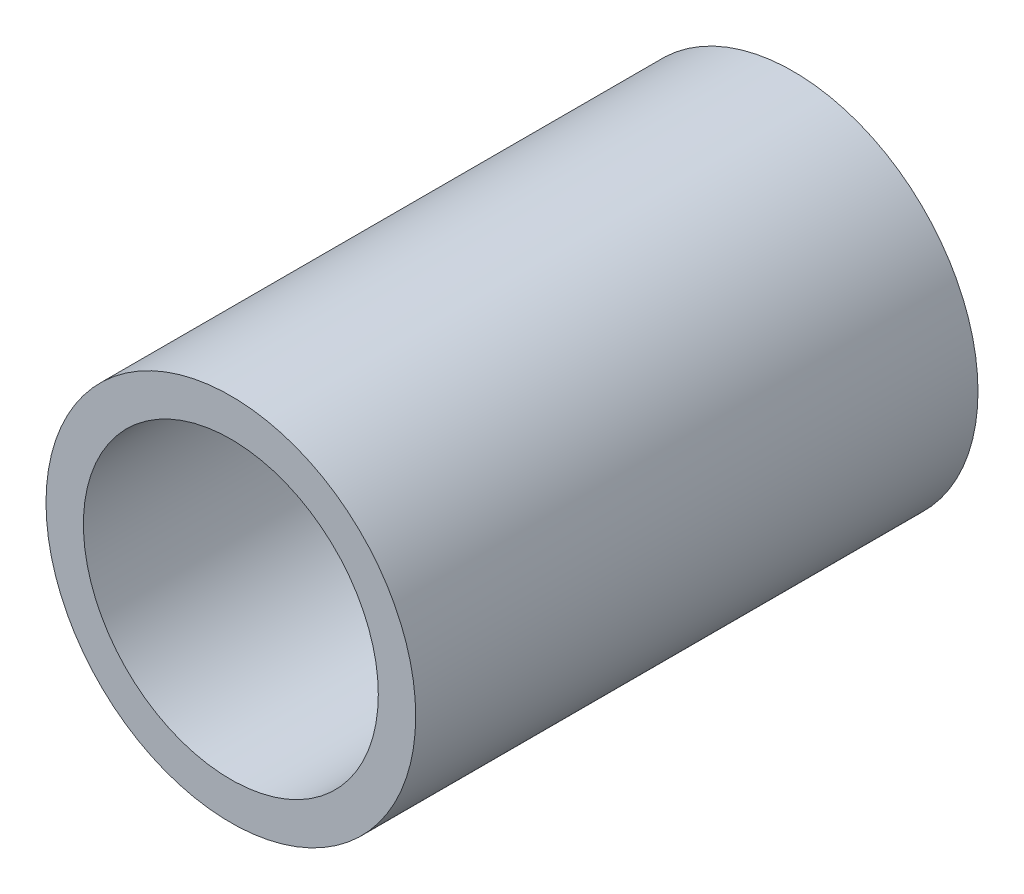
ISO-10303-21;
HEADER;
FILE_DESCRIPTION(('STEP AP214'),'2;1');
FILE_NAME('part.step','',(''),(''),'','','');
FILE_SCHEMA(('AUTOMOTIVE_DESIGN { 1 0 10303 214 1 1 1 1 }'));
ENDSEC;
DATA;
#1=APPLICATION_CONTEXT('core data for automotive mechanical design processes');
#2=APPLICATION_PROTOCOL_DEFINITION('international standard','automotive_design',2000,#1);
#3=PRODUCT_CONTEXT('',#1,'mechanical');
#4=PRODUCT('Part','Part','',(#3));
#5=PRODUCT_RELATED_PRODUCT_CATEGORY('part','',(#4));
#6=PRODUCT_DEFINITION_FORMATION('','',#4);
#7=PRODUCT_DEFINITION_CONTEXT('part definition',#1,'design');
#8=PRODUCT_DEFINITION('design','',#6,#7);
#9=PRODUCT_DEFINITION_SHAPE('','',#8);
#10=(LENGTH_UNIT() NAMED_UNIT(*) SI_UNIT(.MILLI.,.METRE.));
#11=(NAMED_UNIT(*) PLANE_ANGLE_UNIT() SI_UNIT($,.RADIAN.));
#12=(NAMED_UNIT(*) SI_UNIT($,.STERADIAN.) SOLID_ANGLE_UNIT());
#13=UNCERTAINTY_MEASURE_WITH_UNIT(LENGTH_MEASURE(1.E-05),#10,'distance_accuracy_value','');
#14=(GEOMETRIC_REPRESENTATION_CONTEXT(3) GLOBAL_UNCERTAINTY_ASSIGNED_CONTEXT((#13)) GLOBAL_UNIT_ASSIGNED_CONTEXT((#10,
#11,#12)) REPRESENTATION_CONTEXT('',''));
#15=CARTESIAN_POINT('',(0.,0.,0.));
#16=DIRECTION('',(0.,0.,1.));
#17=DIRECTION('',(1.,0.,0.));
#18=AXIS2_PLACEMENT_3D('',#15,#16,#17);
#19=CARTESIAN_POINT('',(0.,0.,25.4));
#20=DIRECTION('',(0.,0.,1.));
#21=DIRECTION('',(1.,0.,0.));
#22=AXIS2_PLACEMENT_3D('',#19,#20,#21);
#23=PLANE('',#22);
#24=CARTESIAN_POINT('',(0.,0.,25.4));
#25=DIRECTION('',(0.,0.,1.));
#26=DIRECTION('',(1.,0.,0.));
#27=AXIS2_PLACEMENT_3D('',#24,#25,#26);
#28=CIRCLE('',#27,16.7005);
#29=CARTESIAN_POINT('',(16.7005,0.,25.4));
#30=VERTEX_POINT('',#29);
#31=EDGE_CURVE('E11',#30,#30,#28,.T.);
#32=ORIENTED_EDGE('',*,*,#31,.T.);
#33=EDGE_LOOP('',(#32));
#34=FACE_BOUND('',#33,.T.);
#35=CARTESIAN_POINT('',(0.,0.,25.4));
#36=DIRECTION('',(0.,0.,1.));
#37=DIRECTION('',(1.,0.,0.));
#38=AXIS2_PLACEMENT_3D('',#35,#36,#37);
#39=CIRCLE('',#38,13.3223);
#40=CARTESIAN_POINT('',(13.3223,0.,25.4));
#41=VERTEX_POINT('',#40);
#42=EDGE_CURVE('E48',#41,#41,#39,.T.);
#43=ORIENTED_EDGE('',*,*,#42,.F.);
#44=EDGE_LOOP('',(#43));
#45=FACE_BOUND('',#44,.T.);
#46=ADVANCED_FACE('F37',(#34,#45),#23,.T.);
#47=CARTESIAN_POINT('',(0.,0.,-25.4));
#48=DIRECTION('',(0.,0.,1.));
#49=DIRECTION('',(1.,0.,0.));
#50=AXIS2_PLACEMENT_3D('',#47,#48,#49);
#51=PLANE('',#50);
#52=CARTESIAN_POINT('',(0.,0.,-25.4));
#53=DIRECTION('',(0.,0.,1.));
#54=DIRECTION('',(1.,0.,0.));
#55=AXIS2_PLACEMENT_3D('',#52,#53,#54);
#56=CIRCLE('',#55,16.7005);
#57=CARTESIAN_POINT('',(16.7005,0.,-25.4));
#58=VERTEX_POINT('',#57);
#59=EDGE_CURVE('E41',#58,#58,#56,.T.);
#60=ORIENTED_EDGE('',*,*,#59,.F.);
#61=EDGE_LOOP('',(#60));
#62=FACE_BOUND('',#61,.T.);
#63=CARTESIAN_POINT('',(0.,0.,-25.4));
#64=DIRECTION('',(0.,0.,1.));
#65=DIRECTION('',(1.,0.,0.));
#66=AXIS2_PLACEMENT_3D('',#63,#64,#65);
#67=CIRCLE('',#66,13.3223);
#68=CARTESIAN_POINT('',(13.3223,0.,-25.4));
#69=VERTEX_POINT('',#68);
#70=EDGE_CURVE('E50',#69,#69,#67,.T.);
#71=ORIENTED_EDGE('',*,*,#70,.T.);
#72=EDGE_LOOP('',(#71));
#73=FACE_BOUND('',#72,.T.);
#74=ADVANCED_FACE('F60',(#62,#73),#51,.F.);
#75=CARTESIAN_POINT('',(0.,0.,25.4));
#76=DIRECTION('',(0.,0.,-1.));
#77=DIRECTION('',(-1.,0.,0.));
#78=AXIS2_PLACEMENT_3D('',#75,#76,#77);
#79=CYLINDRICAL_SURFACE('',#78,16.7005);
#80=ORIENTED_EDGE('',*,*,#31,.F.);
#81=EDGE_LOOP('',(#80));
#82=FACE_BOUND('',#81,.T.);
#83=ORIENTED_EDGE('',*,*,#59,.T.);
#84=EDGE_LOOP('',(#83));
#85=FACE_BOUND('',#84,.T.);
#86=ADVANCED_FACE('F39',(#82,#85),#79,.T.);
#87=CARTESIAN_POINT('',(0.,0.,25.4));
#88=DIRECTION('',(0.,0.,-1.));
#89=DIRECTION('',(-1.,0.,0.));
#90=AXIS2_PLACEMENT_3D('',#87,#88,#89);
#91=CYLINDRICAL_SURFACE('',#90,13.3223);
#92=ORIENTED_EDGE('',*,*,#42,.T.);
#93=EDGE_LOOP('',(#92));
#94=FACE_BOUND('',#93,.T.);
#95=ORIENTED_EDGE('',*,*,#70,.F.);
#96=EDGE_LOOP('',(#95));
#97=FACE_BOUND('',#96,.T.);
#98=ADVANCED_FACE('F56',(#94,#97),#91,.F.);
#99=CLOSED_SHELL('',(#46,#74,#86,#98));
#100=MANIFOLD_SOLID_BREP('B2',#99);
#101=ADVANCED_BREP_SHAPE_REPRESENTATION('',(#18,#100),#14);
#102=SHAPE_DEFINITION_REPRESENTATION(#9,#101);
ENDSEC;
END-ISO-10303-21;
